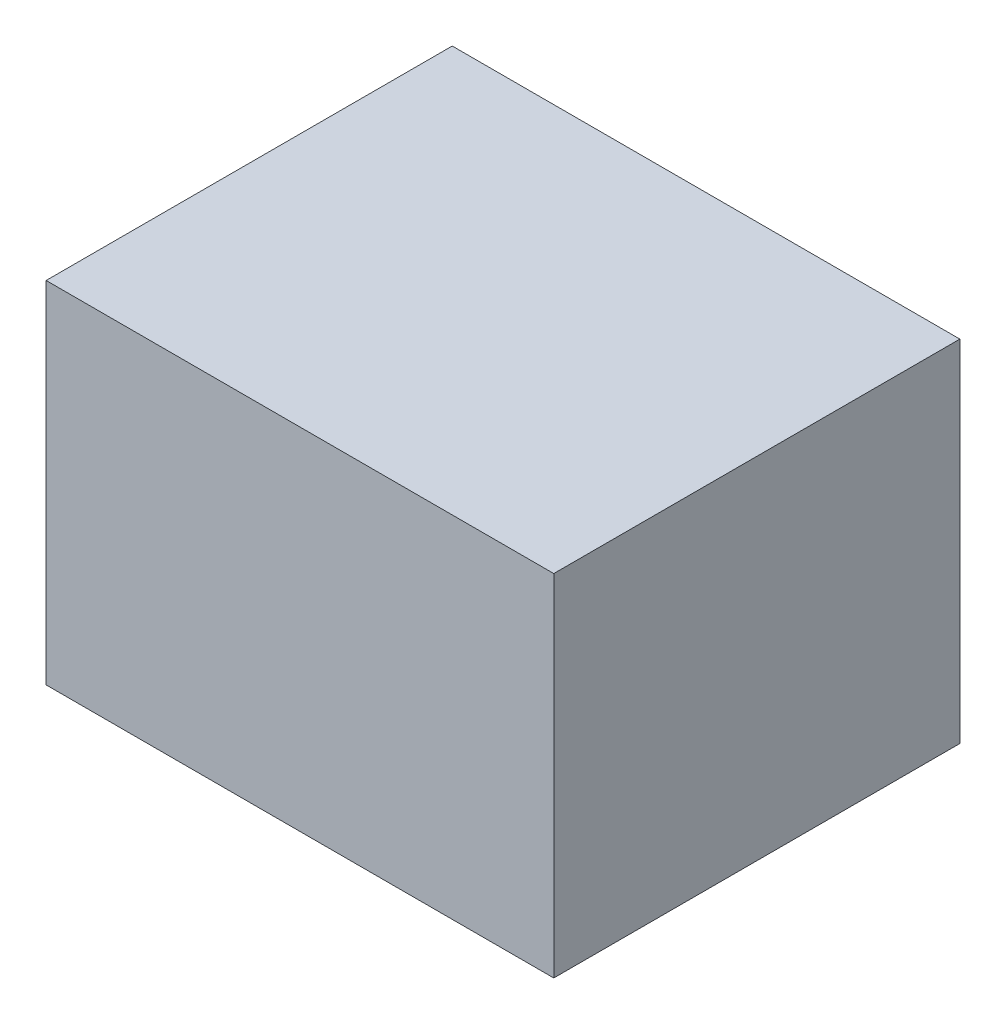
ISO-10303-21;
HEADER;
FILE_DESCRIPTION(('STEP AP214'),'2;1');
FILE_NAME('part.step','',(''),(''),'','','');
FILE_SCHEMA(('AUTOMOTIVE_DESIGN { 1 0 10303 214 1 1 1 1 }'));
ENDSEC;
DATA;
#1=APPLICATION_CONTEXT('core data for automotive mechanical design processes');
#2=APPLICATION_PROTOCOL_DEFINITION('international standard','automotive_design',2000,#1);
#3=PRODUCT_CONTEXT('',#1,'mechanical');
#4=PRODUCT('Part','Part','',(#3));
#5=PRODUCT_RELATED_PRODUCT_CATEGORY('part','',(#4));
#6=PRODUCT_DEFINITION_FORMATION('','',#4);
#7=PRODUCT_DEFINITION_CONTEXT('part definition',#1,'design');
#8=PRODUCT_DEFINITION('design','',#6,#7);
#9=PRODUCT_DEFINITION_SHAPE('','',#8);
#10=(LENGTH_UNIT() NAMED_UNIT(*) SI_UNIT(.MILLI.,.METRE.));
#11=(NAMED_UNIT(*) PLANE_ANGLE_UNIT() SI_UNIT($,.RADIAN.));
#12=(NAMED_UNIT(*) SI_UNIT($,.STERADIAN.) SOLID_ANGLE_UNIT());
#13=UNCERTAINTY_MEASURE_WITH_UNIT(LENGTH_MEASURE(1.E-05),#10,'distance_accuracy_value','');
#14=(GEOMETRIC_REPRESENTATION_CONTEXT(3) GLOBAL_UNCERTAINTY_ASSIGNED_CONTEXT((#13)) GLOBAL_UNIT_ASSIGNED_CONTEXT((#10,
#11,#12)) REPRESENTATION_CONTEXT('',''));
#15=CARTESIAN_POINT('',(0.,0.,0.));
#16=DIRECTION('',(0.,0.,1.));
#17=DIRECTION('',(1.,0.,0.));
#18=AXIS2_PLACEMENT_3D('',#15,#16,#17);
#19=CARTESIAN_POINT('',(0.,26.289,0.));
#20=DIRECTION('',(-1.,0.,0.));
#21=DIRECTION('',(0.,0.,1.));
#22=AXIS2_PLACEMENT_3D('',#19,#20,#21);
#23=PLANE('',#22);
#24=DIRECTION('',(0.,0.,-1.));
#25=VECTOR('',#24,1.);
#26=CARTESIAN_POINT('',(0.,0.,0.));
#27=LINE('',#26,#25);
#28=CARTESIAN_POINT('',(0.,0.,0.));
#29=VERTEX_POINT('',#28);
#30=CARTESIAN_POINT('',(0.,0.,-30.48));
#31=VERTEX_POINT('',#30);
#32=EDGE_CURVE('E107',#29,#31,#27,.T.);
#33=ORIENTED_EDGE('',*,*,#32,.T.);
#34=DIRECTION('',(0.,-1.,0.));
#35=VECTOR('',#34,1.);
#36=CARTESIAN_POINT('',(0.,26.289,-30.48));
#37=LINE('',#36,#35);
#38=CARTESIAN_POINT('',(0.,26.289,-30.48));
#39=VERTEX_POINT('',#38);
#40=EDGE_CURVE('E11',#39,#31,#37,.T.);
#41=ORIENTED_EDGE('',*,*,#40,.F.);
#42=DIRECTION('',(0.,0.,-1.));
#43=VECTOR('',#42,1.);
#44=CARTESIAN_POINT('',(0.,26.289,0.));
#45=LINE('',#44,#43);
#46=CARTESIAN_POINT('',(0.,26.289,0.));
#47=VERTEX_POINT('',#46);
#48=EDGE_CURVE('E91',#47,#39,#45,.T.);
#49=ORIENTED_EDGE('',*,*,#48,.F.);
#50=DIRECTION('',(0.,-1.,0.));
#51=VECTOR('',#50,1.);
#52=CARTESIAN_POINT('',(0.,26.289,0.));
#53=LINE('',#52,#51);
#54=EDGE_CURVE('E103',#47,#29,#53,.T.);
#55=ORIENTED_EDGE('',*,*,#54,.T.);
#56=EDGE_LOOP('',(#33,#41,#49,#55));
#57=FACE_BOUND('',#56,.T.);
#58=ADVANCED_FACE('F39',(#57),#23,.F.);
#59=CARTESIAN_POINT('',(0.,26.289,-30.48));
#60=DIRECTION('',(0.,0.,1.));
#61=DIRECTION('',(1.,0.,0.));
#62=AXIS2_PLACEMENT_3D('',#59,#60,#61);
#63=PLANE('',#62);
#64=DIRECTION('',(-1.,0.,0.));
#65=VECTOR('',#64,1.);
#66=CARTESIAN_POINT('',(0.,0.,-30.48));
#67=LINE('',#66,#65);
#68=CARTESIAN_POINT('',(-38.1,0.,-30.48));
#69=VERTEX_POINT('',#68);
#70=EDGE_CURVE('E96',#31,#69,#67,.T.);
#71=ORIENTED_EDGE('',*,*,#70,.T.);
#72=DIRECTION('',(0.,-1.,0.));
#73=VECTOR('',#72,1.);
#74=CARTESIAN_POINT('',(-38.1,26.289,-30.48));
#75=LINE('',#74,#73);
#76=CARTESIAN_POINT('',(-38.1,26.289,-30.48));
#77=VERTEX_POINT('',#76);
#78=EDGE_CURVE('E48',#77,#69,#75,.T.);
#79=ORIENTED_EDGE('',*,*,#78,.F.);
#80=DIRECTION('',(-1.,0.,0.));
#81=VECTOR('',#80,1.);
#82=CARTESIAN_POINT('',(0.,26.289,-30.48));
#83=LINE('',#82,#81);
#84=EDGE_CURVE('E86',#39,#77,#83,.T.);
#85=ORIENTED_EDGE('',*,*,#84,.F.);
#86=ORIENTED_EDGE('',*,*,#40,.T.);
#87=EDGE_LOOP('',(#71,#79,#85,#86));
#88=FACE_BOUND('',#87,.T.);
#89=ADVANCED_FACE('F95',(#88),#63,.F.);
#90=CARTESIAN_POINT('',(-38.1,26.289,0.));
#91=DIRECTION('',(1.,0.,0.));
#92=DIRECTION('',(0.,0.,-1.));
#93=AXIS2_PLACEMENT_3D('',#90,#91,#92);
#94=PLANE('',#93);
#95=DIRECTION('',(0.,0.,1.));
#96=VECTOR('',#95,1.);
#97=CARTESIAN_POINT('',(-38.1,0.,0.));
#98=LINE('',#97,#96);
#99=CARTESIAN_POINT('',(-38.1,0.,0.));
#100=VERTEX_POINT('',#99);
#101=EDGE_CURVE('E73',#69,#100,#98,.T.);
#102=ORIENTED_EDGE('',*,*,#101,.T.);
#103=DIRECTION('',(0.,-1.,0.));
#104=VECTOR('',#103,1.);
#105=CARTESIAN_POINT('',(-38.1,26.289,0.));
#106=LINE('',#105,#104);
#107=CARTESIAN_POINT('',(-38.1,26.289,0.));
#108=VERTEX_POINT('',#107);
#109=EDGE_CURVE('E98',#108,#100,#106,.T.);
#110=ORIENTED_EDGE('',*,*,#109,.F.);
#111=DIRECTION('',(0.,0.,1.));
#112=VECTOR('',#111,1.);
#113=CARTESIAN_POINT('',(-38.1,26.289,0.));
#114=LINE('',#113,#112);
#115=EDGE_CURVE('E89',#77,#108,#114,.T.);
#116=ORIENTED_EDGE('',*,*,#115,.F.);
#117=ORIENTED_EDGE('',*,*,#78,.T.);
#118=EDGE_LOOP('',(#102,#110,#116,#117));
#119=FACE_BOUND('',#118,.T.);
#120=ADVANCED_FACE('F99',(#119),#94,.F.);
#121=CARTESIAN_POINT('',(0.,26.289,0.));
#122=DIRECTION('',(0.,0.,-1.));
#123=DIRECTION('',(-1.,0.,0.));
#124=AXIS2_PLACEMENT_3D('',#121,#122,#123);
#125=PLANE('',#124);
#126=DIRECTION('',(1.,0.,0.));
#127=VECTOR('',#126,1.);
#128=CARTESIAN_POINT('',(0.,0.,0.));
#129=LINE('',#128,#127);
#130=EDGE_CURVE('E79',#100,#29,#129,.T.);
#131=ORIENTED_EDGE('',*,*,#130,.T.);
#132=ORIENTED_EDGE('',*,*,#54,.F.);
#133=DIRECTION('',(1.,0.,0.));
#134=VECTOR('',#133,1.);
#135=CARTESIAN_POINT('',(0.,26.289,0.));
#136=LINE('',#135,#134);
#137=EDGE_CURVE('E56',#108,#47,#136,.T.);
#138=ORIENTED_EDGE('',*,*,#137,.F.);
#139=ORIENTED_EDGE('',*,*,#109,.T.);
#140=EDGE_LOOP('',(#131,#132,#138,#139));
#141=FACE_BOUND('',#140,.T.);
#142=ADVANCED_FACE('F120',(#141),#125,.F.);
#143=CARTESIAN_POINT('',(0.,26.289,0.));
#144=DIRECTION('',(0.,1.,0.));
#145=DIRECTION('',(0.,0.,1.));
#146=AXIS2_PLACEMENT_3D('',#143,#144,#145);
#147=PLANE('',#146);
#148=ORIENTED_EDGE('',*,*,#48,.T.);
#149=ORIENTED_EDGE('',*,*,#84,.T.);
#150=ORIENTED_EDGE('',*,*,#115,.T.);
#151=ORIENTED_EDGE('',*,*,#137,.T.);
#152=EDGE_LOOP('',(#148,#149,#150,#151));
#153=FACE_BOUND('',#152,.T.);
#154=ADVANCED_FACE('F87',(#153),#147,.T.);
#155=CARTESIAN_POINT('',(0.,0.,0.));
#156=DIRECTION('',(0.,1.,0.));
#157=DIRECTION('',(0.,0.,1.));
#158=AXIS2_PLACEMENT_3D('',#155,#156,#157);
#159=PLANE('',#158);
#160=ORIENTED_EDGE('',*,*,#32,.F.);
#161=ORIENTED_EDGE('',*,*,#130,.F.);
#162=ORIENTED_EDGE('',*,*,#101,.F.);
#163=ORIENTED_EDGE('',*,*,#70,.F.);
#164=EDGE_LOOP('',(#160,#161,#162,#163));
#165=FACE_BOUND('',#164,.T.);
#166=ADVANCED_FACE('F123',(#165),#159,.F.);
#167=CLOSED_SHELL('',(#58,#89,#120,#142,#154,#166));
#168=MANIFOLD_SOLID_BREP('B2',#167);
#169=ADVANCED_BREP_SHAPE_REPRESENTATION('',(#18,#168),#14);
#170=SHAPE_DEFINITION_REPRESENTATION(#9,#169);
ENDSEC;
END-ISO-10303-21;
